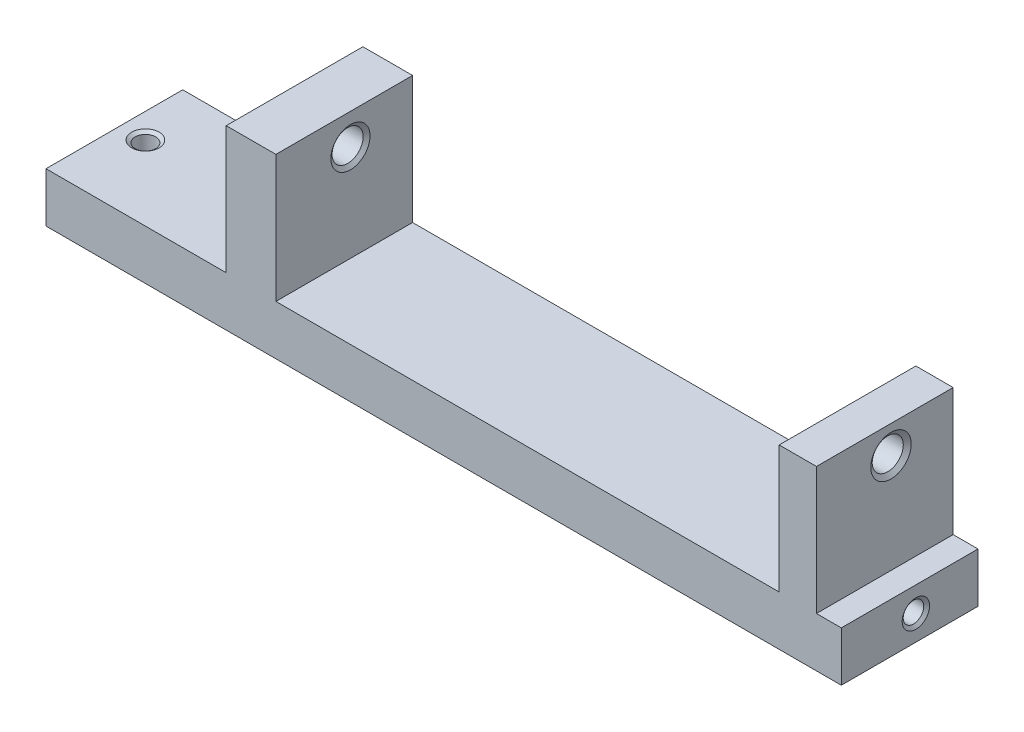
ISO-10303-21;
HEADER;
FILE_DESCRIPTION(('STEP AP214'),'2;1');
FILE_NAME('part.step','',(''),(''),'','','');
FILE_SCHEMA(('AUTOMOTIVE_DESIGN { 1 0 10303 214 1 1 1 1 }'));
ENDSEC;
DATA;
#1=APPLICATION_CONTEXT('core data for automotive mechanical design processes');
#2=APPLICATION_PROTOCOL_DEFINITION('international standard','automotive_design',2000,#1);
#3=PRODUCT_CONTEXT('',#1,'mechanical');
#4=PRODUCT('Part','Part','',(#3));
#5=PRODUCT_RELATED_PRODUCT_CATEGORY('part','',(#4));
#6=PRODUCT_DEFINITION_FORMATION('','',#4);
#7=PRODUCT_DEFINITION_CONTEXT('part definition',#1,'design');
#8=PRODUCT_DEFINITION('design','',#6,#7);
#9=PRODUCT_DEFINITION_SHAPE('','',#8);
#10=(LENGTH_UNIT() NAMED_UNIT(*) SI_UNIT(.MILLI.,.METRE.));
#11=(NAMED_UNIT(*) PLANE_ANGLE_UNIT() SI_UNIT($,.RADIAN.));
#12=(NAMED_UNIT(*) SI_UNIT($,.STERADIAN.) SOLID_ANGLE_UNIT());
#13=UNCERTAINTY_MEASURE_WITH_UNIT(LENGTH_MEASURE(1.E-05),#10,'distance_accuracy_value','');
#14=(GEOMETRIC_REPRESENTATION_CONTEXT(3) GLOBAL_UNCERTAINTY_ASSIGNED_CONTEXT((#13)) GLOBAL_UNIT_ASSIGNED_CONTEXT((#10,
#11,#12)) REPRESENTATION_CONTEXT('',''));
#15=CARTESIAN_POINT('',(0.,0.,0.));
#16=DIRECTION('',(0.,0.,1.));
#17=DIRECTION('',(1.,0.,0.));
#18=AXIS2_PLACEMENT_3D('',#15,#16,#17);
#19=CARTESIAN_POINT('',(0.,7.99999999999998,22.));
#20=DIRECTION('',(1.,0.,0.));
#21=DIRECTION('',(0.,1.,0.));
#22=AXIS2_PLACEMENT_3D('',#19,#20,#21);
#23=PLANE('',#22);
#24=DIRECTION('',(0.,-1.,0.));
#25=VECTOR('',#24,1.);
#26=CARTESIAN_POINT('',(0.,7.99999999999998,0.));
#27=LINE('',#26,#25);
#28=CARTESIAN_POINT('',(0.,7.99999999999998,0.));
#29=VERTEX_POINT('',#28);
#30=CARTESIAN_POINT('',(0.,0.,0.));
#31=VERTEX_POINT('',#30);
#32=EDGE_CURVE('E153',#29,#31,#27,.T.);
#33=ORIENTED_EDGE('',*,*,#32,.T.);
#34=DIRECTION('',(0.,0.,-1.));
#35=VECTOR('',#34,1.);
#36=CARTESIAN_POINT('',(0.,0.,22.));
#37=LINE('',#36,#35);
#38=CARTESIAN_POINT('',(0.,0.,22.));
#39=VERTEX_POINT('',#38);
#40=EDGE_CURVE('E11',#39,#31,#37,.T.);
#41=ORIENTED_EDGE('',*,*,#40,.F.);
#42=DIRECTION('',(0.,-1.,0.));
#43=VECTOR('',#42,1.);
#44=CARTESIAN_POINT('',(0.,7.99999999999998,22.));
#45=LINE('',#44,#43);
#46=CARTESIAN_POINT('',(0.,7.99999999999998,22.));
#47=VERTEX_POINT('',#46);
#48=EDGE_CURVE('E176',#47,#39,#45,.T.);
#49=ORIENTED_EDGE('',*,*,#48,.F.);
#50=DIRECTION('',(0.,0.,-1.));
#51=VECTOR('',#50,1.);
#52=CARTESIAN_POINT('',(0.,7.99999999999998,22.));
#53=LINE('',#52,#51);
#54=EDGE_CURVE('E149',#47,#29,#53,.T.);
#55=ORIENTED_EDGE('',*,*,#54,.T.);
#56=EDGE_LOOP('',(#33,#41,#49,#55));
#57=FACE_BOUND('',#56,.T.);
#58=ADVANCED_FACE('F31',(#57),#23,.F.);
#59=CARTESIAN_POINT('',(0.,0.,22.));
#60=DIRECTION('',(0.,1.,0.));
#61=DIRECTION('',(0.,0.,1.));
#62=AXIS2_PLACEMENT_3D('',#59,#60,#61);
#63=PLANE('',#62);
#64=CARTESIAN_POINT('',(4.,0.,10.));
#65=DIRECTION('',(0.,-1.,0.));
#66=DIRECTION('',(0.,0.,-1.));
#67=AXIS2_PLACEMENT_3D('',#64,#65,#66);
#68=CIRCLE('',#67,2.2);
#69=CARTESIAN_POINT('',(4.,0.,7.8));
#70=VERTEX_POINT('',#69);
#71=EDGE_CURVE('E481',#70,#70,#68,.T.);
#72=ORIENTED_EDGE('',*,*,#71,.F.);
#73=EDGE_LOOP('',(#72));
#74=FACE_BOUND('',#73,.T.);
#75=DIRECTION('',(1.,0.,0.));
#76=VECTOR('',#75,1.);
#77=CARTESIAN_POINT('',(0.,0.,0.));
#78=LINE('',#77,#76);
#79=CARTESIAN_POINT('',(128.,0.,0.));
#80=VERTEX_POINT('',#79);
#81=EDGE_CURVE('E156',#31,#80,#78,.T.);
#82=ORIENTED_EDGE('',*,*,#81,.T.);
#83=DIRECTION('',(0.,0.,-1.));
#84=VECTOR('',#83,1.);
#85=CARTESIAN_POINT('',(128.,0.,22.));
#86=LINE('',#85,#84);
#87=CARTESIAN_POINT('',(128.,0.,22.));
#88=VERTEX_POINT('',#87);
#89=EDGE_CURVE('E39',#88,#80,#86,.T.);
#90=ORIENTED_EDGE('',*,*,#89,.F.);
#91=DIRECTION('',(1.,0.,0.));
#92=VECTOR('',#91,1.);
#93=CARTESIAN_POINT('',(0.,0.,22.));
#94=LINE('',#93,#92);
#95=EDGE_CURVE('E103',#39,#88,#94,.T.);
#96=ORIENTED_EDGE('',*,*,#95,.F.);
#97=ORIENTED_EDGE('',*,*,#40,.T.);
#98=EDGE_LOOP('',(#82,#90,#96,#97));
#99=FACE_BOUND('',#98,.T.);
#100=ADVANCED_FACE('F257',(#74,#99),#63,.F.);
#101=CARTESIAN_POINT('',(128.,0.,22.));
#102=DIRECTION('',(-1.,0.,0.));
#103=DIRECTION('',(0.,0.,1.));
#104=AXIS2_PLACEMENT_3D('',#101,#102,#103);
#105=PLANE('',#104);
#106=CARTESIAN_POINT('',(128.,4.,10.));
#107=DIRECTION('',(1.,0.,0.));
#108=DIRECTION('',(0.,0.,-1.));
#109=AXIS2_PLACEMENT_3D('',#106,#107,#108);
#110=CIRCLE('',#109,2.2);
#111=CARTESIAN_POINT('',(128.,4.,7.8));
#112=VERTEX_POINT('',#111);
#113=EDGE_CURVE('E472',#112,#112,#110,.T.);
#114=ORIENTED_EDGE('',*,*,#113,.F.);
#115=EDGE_LOOP('',(#114));
#116=FACE_BOUND('',#115,.T.);
#117=DIRECTION('',(0.,1.,0.));
#118=VECTOR('',#117,1.);
#119=CARTESIAN_POINT('',(128.,0.,0.));
#120=LINE('',#119,#118);
#121=CARTESIAN_POINT('',(128.,8.,0.));
#122=VERTEX_POINT('',#121);
#123=EDGE_CURVE('E159',#80,#122,#120,.T.);
#124=ORIENTED_EDGE('',*,*,#123,.T.);
#125=DIRECTION('',(0.,0.,-1.));
#126=VECTOR('',#125,1.);
#127=CARTESIAN_POINT('',(128.,8.,22.));
#128=LINE('',#127,#126);
#129=CARTESIAN_POINT('',(128.,8.,22.));
#130=VERTEX_POINT('',#129);
#131=EDGE_CURVE('E195',#130,#122,#128,.T.);
#132=ORIENTED_EDGE('',*,*,#131,.F.);
#133=DIRECTION('',(0.,1.,0.));
#134=VECTOR('',#133,1.);
#135=CARTESIAN_POINT('',(128.,0.,22.));
#136=LINE('',#135,#134);
#137=EDGE_CURVE('E203',#88,#130,#136,.T.);
#138=ORIENTED_EDGE('',*,*,#137,.F.);
#139=ORIENTED_EDGE('',*,*,#89,.T.);
#140=EDGE_LOOP('',(#124,#132,#138,#139));
#141=FACE_BOUND('',#140,.T.);
#142=ADVANCED_FACE('F201',(#116,#141),#105,.F.);
#143=CARTESIAN_POINT('',(128.,8.,22.));
#144=DIRECTION('',(0.,-1.,0.));
#145=DIRECTION('',(0.,0.,-1.));
#146=AXIS2_PLACEMENT_3D('',#143,#144,#145);
#147=PLANE('',#146);
#148=DIRECTION('',(-1.,0.,0.));
#149=VECTOR('',#148,1.);
#150=CARTESIAN_POINT('',(128.,8.,0.));
#151=LINE('',#150,#149);
#152=CARTESIAN_POINT('',(124.,8.,0.));
#153=VERTEX_POINT('',#152);
#154=EDGE_CURVE('E161',#122,#153,#151,.T.);
#155=ORIENTED_EDGE('',*,*,#154,.T.);
#156=DIRECTION('',(0.,0.,-1.));
#157=VECTOR('',#156,1.);
#158=CARTESIAN_POINT('',(124.,8.,22.));
#159=LINE('',#158,#157);
#160=CARTESIAN_POINT('',(124.,8.,22.));
#161=VERTEX_POINT('',#160);
#162=EDGE_CURVE('E192',#161,#153,#159,.T.);
#163=ORIENTED_EDGE('',*,*,#162,.F.);
#164=DIRECTION('',(-1.,0.,0.));
#165=VECTOR('',#164,1.);
#166=CARTESIAN_POINT('',(128.,8.,22.));
#167=LINE('',#166,#165);
#168=EDGE_CURVE('E221',#130,#161,#167,.T.);
#169=ORIENTED_EDGE('',*,*,#168,.F.);
#170=ORIENTED_EDGE('',*,*,#131,.T.);
#171=EDGE_LOOP('',(#155,#163,#169,#170));
#172=FACE_BOUND('',#171,.T.);
#173=ADVANCED_FACE('F212',(#172),#147,.F.);
#174=CARTESIAN_POINT('',(124.,8.,22.));
#175=DIRECTION('',(-1.,0.,0.));
#176=DIRECTION('',(0.,0.,1.));
#177=AXIS2_PLACEMENT_3D('',#174,#175,#176);
#178=PLANE('',#177);
#179=CARTESIAN_POINT('',(124.,24.,10.));
#180=DIRECTION('',(1.,0.,0.));
#181=DIRECTION('',(0.,0.,-1.));
#182=AXIS2_PLACEMENT_3D('',#179,#180,#181);
#183=CIRCLE('',#182,3.25);
#184=CARTESIAN_POINT('',(124.,24.,6.75));
#185=VERTEX_POINT('',#184);
#186=EDGE_CURVE('E493',#185,#185,#183,.T.);
#187=ORIENTED_EDGE('',*,*,#186,.F.);
#188=EDGE_LOOP('',(#187));
#189=FACE_BOUND('',#188,.T.);
#190=DIRECTION('',(0.,1.,0.));
#191=VECTOR('',#190,1.);
#192=CARTESIAN_POINT('',(124.,8.,0.));
#193=LINE('',#192,#191);
#194=CARTESIAN_POINT('',(124.,28.5,0.));
#195=VERTEX_POINT('',#194);
#196=EDGE_CURVE('E163',#153,#195,#193,.T.);
#197=ORIENTED_EDGE('',*,*,#196,.T.);
#198=DIRECTION('',(0.,0.,-1.));
#199=VECTOR('',#198,1.);
#200=CARTESIAN_POINT('',(124.,28.5,22.));
#201=LINE('',#200,#199);
#202=CARTESIAN_POINT('',(124.,28.5,22.));
#203=VERTEX_POINT('',#202);
#204=EDGE_CURVE('E189',#203,#195,#201,.T.);
#205=ORIENTED_EDGE('',*,*,#204,.F.);
#206=DIRECTION('',(0.,1.,0.));
#207=VECTOR('',#206,1.);
#208=CARTESIAN_POINT('',(124.,8.,22.));
#209=LINE('',#208,#207);
#210=EDGE_CURVE('E218',#161,#203,#209,.T.);
#211=ORIENTED_EDGE('',*,*,#210,.F.);
#212=ORIENTED_EDGE('',*,*,#162,.T.);
#213=EDGE_LOOP('',(#197,#205,#211,#212));
#214=FACE_BOUND('',#213,.T.);
#215=ADVANCED_FACE('F216',(#189,#214),#178,.F.);
#216=CARTESIAN_POINT('',(124.,28.5,22.));
#217=DIRECTION('',(0.,-1.,0.));
#218=DIRECTION('',(0.,0.,-1.));
#219=AXIS2_PLACEMENT_3D('',#216,#217,#218);
#220=PLANE('',#219);
#221=DIRECTION('',(-1.,0.,0.));
#222=VECTOR('',#221,1.);
#223=CARTESIAN_POINT('',(124.,28.5,0.));
#224=LINE('',#223,#222);
#225=CARTESIAN_POINT('',(118.,28.5,0.));
#226=VERTEX_POINT('',#225);
#227=EDGE_CURVE('E165',#195,#226,#224,.T.);
#228=ORIENTED_EDGE('',*,*,#227,.T.);
#229=DIRECTION('',(0.,0.,-1.));
#230=VECTOR('',#229,1.);
#231=CARTESIAN_POINT('',(118.,28.5,22.));
#232=LINE('',#231,#230);
#233=CARTESIAN_POINT('',(118.,28.5,22.));
#234=VERTEX_POINT('',#233);
#235=EDGE_CURVE('E186',#234,#226,#232,.T.);
#236=ORIENTED_EDGE('',*,*,#235,.F.);
#237=DIRECTION('',(-1.,0.,0.));
#238=VECTOR('',#237,1.);
#239=CARTESIAN_POINT('',(124.,28.5,22.));
#240=LINE('',#239,#238);
#241=EDGE_CURVE('E220',#203,#234,#240,.T.);
#242=ORIENTED_EDGE('',*,*,#241,.F.);
#243=ORIENTED_EDGE('',*,*,#204,.T.);
#244=EDGE_LOOP('',(#228,#236,#242,#243));
#245=FACE_BOUND('',#244,.T.);
#246=ADVANCED_FACE('F273',(#245),#220,.F.);
#247=CARTESIAN_POINT('',(118.,28.5,22.));
#248=DIRECTION('',(1.,0.,0.));
#249=DIRECTION('',(0.,0.,-1.));
#250=AXIS2_PLACEMENT_3D('',#247,#248,#249);
#251=PLANE('',#250);
#252=CARTESIAN_POINT('',(118.,24.,10.));
#253=DIRECTION('',(1.,0.,0.));
#254=DIRECTION('',(0.,0.,-1.));
#255=AXIS2_PLACEMENT_3D('',#252,#253,#254);
#256=CIRCLE('',#255,3.25);
#257=CARTESIAN_POINT('',(118.,24.,6.75));
#258=VERTEX_POINT('',#257);
#259=EDGE_CURVE('E490',#258,#258,#256,.T.);
#260=ORIENTED_EDGE('',*,*,#259,.T.);
#261=EDGE_LOOP('',(#260));
#262=FACE_BOUND('',#261,.T.);
#263=DIRECTION('',(0.,-1.,0.));
#264=VECTOR('',#263,1.);
#265=CARTESIAN_POINT('',(118.,28.5,0.));
#266=LINE('',#265,#264);
#267=CARTESIAN_POINT('',(118.,8.,0.));
#268=VERTEX_POINT('',#267);
#269=EDGE_CURVE('E167',#226,#268,#266,.T.);
#270=ORIENTED_EDGE('',*,*,#269,.T.);
#271=DIRECTION('',(0.,0.,-1.));
#272=VECTOR('',#271,1.);
#273=CARTESIAN_POINT('',(118.,8.,22.));
#274=LINE('',#273,#272);
#275=CARTESIAN_POINT('',(118.,8.,22.));
#276=VERTEX_POINT('',#275);
#277=EDGE_CURVE('E183',#276,#268,#274,.T.);
#278=ORIENTED_EDGE('',*,*,#277,.F.);
#279=DIRECTION('',(0.,-1.,0.));
#280=VECTOR('',#279,1.);
#281=CARTESIAN_POINT('',(118.,28.5,22.));
#282=LINE('',#281,#280);
#283=EDGE_CURVE('E223',#234,#276,#282,.T.);
#284=ORIENTED_EDGE('',*,*,#283,.F.);
#285=ORIENTED_EDGE('',*,*,#235,.T.);
#286=EDGE_LOOP('',(#270,#278,#284,#285));
#287=FACE_BOUND('',#286,.T.);
#288=ADVANCED_FACE('F277',(#262,#287),#251,.F.);
#289=CARTESIAN_POINT('',(118.,8.,22.));
#290=DIRECTION('',(0.,-1.,0.));
#291=DIRECTION('',(1.,0.,0.));
#292=AXIS2_PLACEMENT_3D('',#289,#290,#291);
#293=PLANE('',#292);
#294=DIRECTION('',(-1.,0.,0.));
#295=VECTOR('',#294,1.);
#296=CARTESIAN_POINT('',(118.,8.,0.));
#297=LINE('',#296,#295);
#298=CARTESIAN_POINT('',(37.,7.99999999999999,0.));
#299=VERTEX_POINT('',#298);
#300=EDGE_CURVE('E169',#268,#299,#297,.T.);
#301=ORIENTED_EDGE('',*,*,#300,.T.);
#302=DIRECTION('',(0.,0.,-1.));
#303=VECTOR('',#302,1.);
#304=CARTESIAN_POINT('',(37.,7.99999999999999,22.));
#305=LINE('',#304,#303);
#306=CARTESIAN_POINT('',(37.,7.99999999999999,22.));
#307=VERTEX_POINT('',#306);
#308=EDGE_CURVE('E180',#307,#299,#305,.T.);
#309=ORIENTED_EDGE('',*,*,#308,.F.);
#310=DIRECTION('',(-1.,0.,0.));
#311=VECTOR('',#310,1.);
#312=CARTESIAN_POINT('',(118.,8.,22.));
#313=LINE('',#312,#311);
#314=EDGE_CURVE('E229',#276,#307,#313,.T.);
#315=ORIENTED_EDGE('',*,*,#314,.F.);
#316=ORIENTED_EDGE('',*,*,#277,.T.);
#317=EDGE_LOOP('',(#301,#309,#315,#316));
#318=FACE_BOUND('',#317,.T.);
#319=ADVANCED_FACE('F235',(#318),#293,.F.);
#320=CARTESIAN_POINT('',(37.,7.99999999999999,22.));
#321=DIRECTION('',(-1.,0.,0.));
#322=DIRECTION('',(0.,0.,1.));
#323=AXIS2_PLACEMENT_3D('',#320,#321,#322);
#324=PLANE('',#323);
#325=CARTESIAN_POINT('',(37.,23.5,10.));
#326=DIRECTION('',(-1.,0.,0.));
#327=DIRECTION('',(0.,0.,1.));
#328=AXIS2_PLACEMENT_3D('',#325,#326,#327);
#329=CIRCLE('',#328,3.15);
#330=CARTESIAN_POINT('',(37.,23.5,13.15));
#331=VERTEX_POINT('',#330);
#332=EDGE_CURVE('E502',#331,#331,#329,.T.);
#333=ORIENTED_EDGE('',*,*,#332,.T.);
#334=EDGE_LOOP('',(#333));
#335=FACE_BOUND('',#334,.T.);
#336=DIRECTION('',(0.,1.,0.));
#337=VECTOR('',#336,1.);
#338=CARTESIAN_POINT('',(37.,7.99999999999999,0.));
#339=LINE('',#338,#337);
#340=CARTESIAN_POINT('',(37.,28.5,0.));
#341=VERTEX_POINT('',#340);
#342=EDGE_CURVE('E171',#299,#341,#339,.T.);
#343=ORIENTED_EDGE('',*,*,#342,.T.);
#344=DIRECTION('',(0.,0.,-1.));
#345=VECTOR('',#344,1.);
#346=CARTESIAN_POINT('',(37.,28.5,22.));
#347=LINE('',#346,#345);
#348=CARTESIAN_POINT('',(37.,28.5,22.));
#349=VERTEX_POINT('',#348);
#350=EDGE_CURVE('E144',#349,#341,#347,.T.);
#351=ORIENTED_EDGE('',*,*,#350,.F.);
#352=DIRECTION('',(0.,1.,0.));
#353=VECTOR('',#352,1.);
#354=CARTESIAN_POINT('',(37.,7.99999999999999,22.));
#355=LINE('',#354,#353);
#356=EDGE_CURVE('E135',#307,#349,#355,.T.);
#357=ORIENTED_EDGE('',*,*,#356,.F.);
#358=ORIENTED_EDGE('',*,*,#308,.T.);
#359=EDGE_LOOP('',(#343,#351,#357,#358));
#360=FACE_BOUND('',#359,.T.);
#361=ADVANCED_FACE('F239',(#335,#360),#324,.F.);
#362=CARTESIAN_POINT('',(37.,28.5,22.));
#363=DIRECTION('',(0.,-1.,0.));
#364=DIRECTION('',(0.,0.,-1.));
#365=AXIS2_PLACEMENT_3D('',#362,#363,#364);
#366=PLANE('',#365);
#367=DIRECTION('',(-1.,0.,0.));
#368=VECTOR('',#367,1.);
#369=CARTESIAN_POINT('',(37.,28.5,0.));
#370=LINE('',#369,#368);
#371=CARTESIAN_POINT('',(29.,28.5,0.));
#372=VERTEX_POINT('',#371);
#373=EDGE_CURVE('E143',#341,#372,#370,.T.);
#374=ORIENTED_EDGE('',*,*,#373,.T.);
#375=DIRECTION('',(0.,0.,-1.));
#376=VECTOR('',#375,1.);
#377=CARTESIAN_POINT('',(29.,28.5,22.));
#378=LINE('',#377,#376);
#379=CARTESIAN_POINT('',(29.,28.5,22.));
#380=VERTEX_POINT('',#379);
#381=EDGE_CURVE('E140',#380,#372,#378,.T.);
#382=ORIENTED_EDGE('',*,*,#381,.F.);
#383=DIRECTION('',(-1.,0.,0.));
#384=VECTOR('',#383,1.);
#385=CARTESIAN_POINT('',(37.,28.5,22.));
#386=LINE('',#385,#384);
#387=EDGE_CURVE('E129',#349,#380,#386,.T.);
#388=ORIENTED_EDGE('',*,*,#387,.F.);
#389=ORIENTED_EDGE('',*,*,#350,.T.);
#390=EDGE_LOOP('',(#374,#382,#388,#389));
#391=FACE_BOUND('',#390,.T.);
#392=ADVANCED_FACE('F141',(#391),#366,.F.);
#393=CARTESIAN_POINT('',(29.,28.5,22.));
#394=DIRECTION('',(1.,0.,0.));
#395=DIRECTION('',(0.,1.,0.));
#396=AXIS2_PLACEMENT_3D('',#393,#394,#395);
#397=PLANE('',#396);
#398=CARTESIAN_POINT('',(29.,23.5,10.));
#399=DIRECTION('',(-1.,0.,0.));
#400=DIRECTION('',(0.,0.,1.));
#401=AXIS2_PLACEMENT_3D('',#398,#399,#400);
#402=CIRCLE('',#401,3.15);
#403=CARTESIAN_POINT('',(29.,23.5,13.15));
#404=VERTEX_POINT('',#403);
#405=EDGE_CURVE('E505',#404,#404,#402,.T.);
#406=ORIENTED_EDGE('',*,*,#405,.F.);
#407=EDGE_LOOP('',(#406));
#408=FACE_BOUND('',#407,.T.);
#409=DIRECTION('',(0.,-1.,0.));
#410=VECTOR('',#409,1.);
#411=CARTESIAN_POINT('',(29.,28.5,0.));
#412=LINE('',#411,#410);
#413=CARTESIAN_POINT('',(29.,7.99999999999999,0.));
#414=VERTEX_POINT('',#413);
#415=EDGE_CURVE('E89',#372,#414,#412,.T.);
#416=ORIENTED_EDGE('',*,*,#415,.T.);
#417=DIRECTION('',(0.,0.,-1.));
#418=VECTOR('',#417,1.);
#419=CARTESIAN_POINT('',(29.,7.99999999999999,22.));
#420=LINE('',#419,#418);
#421=CARTESIAN_POINT('',(29.,7.99999999999999,22.));
#422=VERTEX_POINT('',#421);
#423=EDGE_CURVE('E145',#422,#414,#420,.T.);
#424=ORIENTED_EDGE('',*,*,#423,.F.);
#425=DIRECTION('',(0.,-1.,0.));
#426=VECTOR('',#425,1.);
#427=CARTESIAN_POINT('',(29.,28.5,22.));
#428=LINE('',#427,#426);
#429=EDGE_CURVE('E133',#380,#422,#428,.T.);
#430=ORIENTED_EDGE('',*,*,#429,.F.);
#431=ORIENTED_EDGE('',*,*,#381,.T.);
#432=EDGE_LOOP('',(#416,#424,#430,#431));
#433=FACE_BOUND('',#432,.T.);
#434=ADVANCED_FACE('F147',(#408,#433),#397,.F.);
#435=CARTESIAN_POINT('',(29.,7.99999999999999,22.));
#436=DIRECTION('',(0.,-1.,0.));
#437=DIRECTION('',(1.,0.,0.));
#438=AXIS2_PLACEMENT_3D('',#435,#436,#437);
#439=PLANE('',#438);
#440=CARTESIAN_POINT('',(4.,7.99999999999998,10.));
#441=DIRECTION('',(0.,-1.,0.));
#442=DIRECTION('',(0.,0.,-1.));
#443=AXIS2_PLACEMENT_3D('',#440,#441,#442);
#444=CIRCLE('',#443,2.2);
#445=CARTESIAN_POINT('',(4.,7.99999999999998,7.8));
#446=VERTEX_POINT('',#445);
#447=EDGE_CURVE('E479',#446,#446,#444,.T.);
#448=ORIENTED_EDGE('',*,*,#447,.T.);
#449=EDGE_LOOP('',(#448));
#450=FACE_BOUND('',#449,.T.);
#451=DIRECTION('',(-1.,0.,0.));
#452=VECTOR('',#451,1.);
#453=CARTESIAN_POINT('',(29.,7.99999999999999,0.));
#454=LINE('',#453,#452);
#455=EDGE_CURVE('E95',#414,#29,#454,.T.);
#456=ORIENTED_EDGE('',*,*,#455,.T.);
#457=ORIENTED_EDGE('',*,*,#54,.F.);
#458=DIRECTION('',(-1.,0.,0.));
#459=VECTOR('',#458,1.);
#460=CARTESIAN_POINT('',(29.,7.99999999999999,22.));
#461=LINE('',#460,#459);
#462=EDGE_CURVE('E47',#422,#47,#461,.T.);
#463=ORIENTED_EDGE('',*,*,#462,.F.);
#464=ORIENTED_EDGE('',*,*,#423,.T.);
#465=EDGE_LOOP('',(#456,#457,#463,#464));
#466=FACE_BOUND('',#465,.T.);
#467=ADVANCED_FACE('F243',(#450,#466),#439,.F.);
#468=CARTESIAN_POINT('',(0.,0.,22.));
#469=DIRECTION('',(0.,0.,1.));
#470=DIRECTION('',(1.,0.,0.));
#471=AXIS2_PLACEMENT_3D('',#468,#469,#470);
#472=PLANE('',#471);
#473=ORIENTED_EDGE('',*,*,#48,.T.);
#474=ORIENTED_EDGE('',*,*,#95,.T.);
#475=ORIENTED_EDGE('',*,*,#137,.T.);
#476=ORIENTED_EDGE('',*,*,#168,.T.);
#477=ORIENTED_EDGE('',*,*,#210,.T.);
#478=ORIENTED_EDGE('',*,*,#241,.T.);
#479=ORIENTED_EDGE('',*,*,#283,.T.);
#480=ORIENTED_EDGE('',*,*,#314,.T.);
#481=ORIENTED_EDGE('',*,*,#356,.T.);
#482=ORIENTED_EDGE('',*,*,#387,.T.);
#483=ORIENTED_EDGE('',*,*,#429,.T.);
#484=ORIENTED_EDGE('',*,*,#462,.T.);
#485=EDGE_LOOP('',(#473,#474,#475,#476,#477,#478,#479,#480,#481,#482,#483,#484));
#486=FACE_BOUND('',#485,.T.);
#487=ADVANCED_FACE('F131',(#486),#472,.T.);
#488=CARTESIAN_POINT('',(0.,0.,0.));
#489=DIRECTION('',(0.,0.,1.));
#490=DIRECTION('',(1.,0.,0.));
#491=AXIS2_PLACEMENT_3D('',#488,#489,#490);
#492=PLANE('',#491);
#493=ORIENTED_EDGE('',*,*,#32,.F.);
#494=ORIENTED_EDGE('',*,*,#455,.F.);
#495=ORIENTED_EDGE('',*,*,#415,.F.);
#496=ORIENTED_EDGE('',*,*,#373,.F.);
#497=ORIENTED_EDGE('',*,*,#342,.F.);
#498=ORIENTED_EDGE('',*,*,#300,.F.);
#499=ORIENTED_EDGE('',*,*,#269,.F.);
#500=ORIENTED_EDGE('',*,*,#227,.F.);
#501=ORIENTED_EDGE('',*,*,#196,.F.);
#502=ORIENTED_EDGE('',*,*,#154,.F.);
#503=ORIENTED_EDGE('',*,*,#123,.F.);
#504=ORIENTED_EDGE('',*,*,#81,.F.);
#505=EDGE_LOOP('',(#493,#494,#495,#496,#497,#498,#499,#500,#501,#502,#503,#504));
#506=FACE_BOUND('',#505,.T.);
#507=ADVANCED_FACE('F207',(#506),#492,.F.);
#508=CARTESIAN_POINT('',(36.5448651001637,23.5,10.));
#509=DIRECTION('',(1.,0.,0.));
#510=DIRECTION('',(0.,0.,-1.));
#511=AXIS2_PLACEMENT_3D('',#508,#509,#510);
#512=CONICAL_SURFACE('',#511,2.5,0.959931088596888);
#513=ORIENTED_EDGE('',*,*,#332,.F.);
#514=EDGE_LOOP('',(#513));
#515=FACE_BOUND('',#514,.T.);
#516=CARTESIAN_POINT('',(36.5448651001637,23.5,10.));
#517=DIRECTION('',(-1.,0.,0.));
#518=DIRECTION('',(0.,0.,1.));
#519=AXIS2_PLACEMENT_3D('',#516,#517,#518);
#520=CIRCLE('',#519,2.5);
#521=CARTESIAN_POINT('',(36.5448651001637,23.5,12.5));
#522=VERTEX_POINT('',#521);
#523=EDGE_CURVE('E157',#522,#522,#520,.T.);
#524=ORIENTED_EDGE('',*,*,#523,.T.);
#525=EDGE_LOOP('',(#524));
#526=FACE_BOUND('',#525,.T.);
#527=ADVANCED_FACE('F307',(#515,#526),#512,.F.);
#528=CARTESIAN_POINT('',(29.,23.5,10.));
#529=DIRECTION('',(-1.,0.,0.));
#530=DIRECTION('',(0.,0.,1.));
#531=AXIS2_PLACEMENT_3D('',#528,#529,#530);
#532=CYLINDRICAL_SURFACE('',#531,2.5);
#533=ORIENTED_EDGE('',*,*,#523,.F.);
#534=EDGE_LOOP('',(#533));
#535=FACE_BOUND('',#534,.T.);
#536=CARTESIAN_POINT('',(29.4551348998363,23.5,10.));
#537=DIRECTION('',(-1.,0.,0.));
#538=DIRECTION('',(0.,0.,1.));
#539=AXIS2_PLACEMENT_3D('',#536,#537,#538);
#540=CIRCLE('',#539,2.5);
#541=CARTESIAN_POINT('',(29.4551348998363,23.5,12.5));
#542=VERTEX_POINT('',#541);
#543=EDGE_CURVE('E508',#542,#542,#540,.T.);
#544=ORIENTED_EDGE('',*,*,#543,.T.);
#545=EDGE_LOOP('',(#544));
#546=FACE_BOUND('',#545,.T.);
#547=ADVANCED_FACE('F312',(#535,#546),#532,.F.);
#548=CARTESIAN_POINT('',(29.,23.5,10.));
#549=DIRECTION('',(-1.,0.,0.));
#550=DIRECTION('',(0.,0.,1.));
#551=AXIS2_PLACEMENT_3D('',#548,#549,#550);
#552=CONICAL_SURFACE('',#551,3.15,0.959931088596885);
#553=ORIENTED_EDGE('',*,*,#543,.F.);
#554=EDGE_LOOP('',(#553));
#555=FACE_BOUND('',#554,.T.);
#556=ORIENTED_EDGE('',*,*,#405,.T.);
#557=EDGE_LOOP('',(#556));
#558=FACE_BOUND('',#557,.T.);
#559=ADVANCED_FACE('F324',(#555,#558),#552,.F.);
#560=CARTESIAN_POINT('',(118.525155653657,24.,10.));
#561=DIRECTION('',(-1.,0.,0.));
#562=DIRECTION('',(0.,0.,1.));
#563=AXIS2_PLACEMENT_3D('',#560,#561,#562);
#564=CONICAL_SURFACE('',#563,2.5,0.959931088596883);
#565=ORIENTED_EDGE('',*,*,#259,.F.);
#566=EDGE_LOOP('',(#565));
#567=FACE_BOUND('',#566,.T.);
#568=CARTESIAN_POINT('',(118.525155653657,24.,10.));
#569=DIRECTION('',(1.,0.,0.));
#570=DIRECTION('',(0.,0.,-1.));
#571=AXIS2_PLACEMENT_3D('',#568,#569,#570);
#572=CIRCLE('',#571,2.5);
#573=CARTESIAN_POINT('',(118.525155653657,24.,7.5));
#574=VERTEX_POINT('',#573);
#575=EDGE_CURVE('E499',#574,#574,#572,.T.);
#576=ORIENTED_EDGE('',*,*,#575,.T.);
#577=EDGE_LOOP('',(#576));
#578=FACE_BOUND('',#577,.T.);
#579=ADVANCED_FACE('F334',(#567,#578),#564,.F.);
#580=CARTESIAN_POINT('',(124.,24.,10.));
#581=DIRECTION('',(1.,0.,0.));
#582=DIRECTION('',(0.,0.,-1.));
#583=AXIS2_PLACEMENT_3D('',#580,#581,#582);
#584=CYLINDRICAL_SURFACE('',#583,2.5);
#585=ORIENTED_EDGE('',*,*,#575,.F.);
#586=EDGE_LOOP('',(#585));
#587=FACE_BOUND('',#586,.T.);
#588=CARTESIAN_POINT('',(123.474844346343,24.,10.));
#589=DIRECTION('',(1.,0.,0.));
#590=DIRECTION('',(0.,0.,-1.));
#591=AXIS2_PLACEMENT_3D('',#588,#589,#590);
#592=CIRCLE('',#591,2.5);
#593=CARTESIAN_POINT('',(123.474844346343,24.,7.5));
#594=VERTEX_POINT('',#593);
#595=EDGE_CURVE('E496',#594,#594,#592,.T.);
#596=ORIENTED_EDGE('',*,*,#595,.T.);
#597=EDGE_LOOP('',(#596));
#598=FACE_BOUND('',#597,.T.);
#599=ADVANCED_FACE('F359',(#587,#598),#584,.F.);
#600=CARTESIAN_POINT('',(124.,24.,10.));
#601=DIRECTION('',(1.,0.,0.));
#602=DIRECTION('',(0.,0.,-1.));
#603=AXIS2_PLACEMENT_3D('',#600,#601,#602);
#604=CONICAL_SURFACE('',#603,3.25,0.959931088596883);
#605=ORIENTED_EDGE('',*,*,#595,.F.);
#606=EDGE_LOOP('',(#605));
#607=FACE_BOUND('',#606,.T.);
#608=ORIENTED_EDGE('',*,*,#186,.T.);
#609=EDGE_LOOP('',(#608));
#610=FACE_BOUND('',#609,.T.);
#611=ADVANCED_FACE('F369',(#607,#610),#604,.F.);
#612=CARTESIAN_POINT('',(4.,7.61488585398464,10.));
#613=DIRECTION('',(0.,1.,0.));
#614=DIRECTION('',(0.,0.,1.));
#615=AXIS2_PLACEMENT_3D('',#612,#613,#614);
#616=CONICAL_SURFACE('',#615,1.65,0.95993108859688);
#617=ORIENTED_EDGE('',*,*,#447,.F.);
#618=EDGE_LOOP('',(#617));
#619=FACE_BOUND('',#618,.T.);
#620=CARTESIAN_POINT('',(4.,7.61488585398464,10.));
#621=DIRECTION('',(0.,-1.,0.));
#622=DIRECTION('',(0.,0.,-1.));
#623=AXIS2_PLACEMENT_3D('',#620,#621,#622);
#624=CIRCLE('',#623,1.65);
#625=CARTESIAN_POINT('',(4.,7.61488585398464,8.35));
#626=VERTEX_POINT('',#625);
#627=EDGE_CURVE('E487',#626,#626,#624,.T.);
#628=ORIENTED_EDGE('',*,*,#627,.T.);
#629=EDGE_LOOP('',(#628));
#630=FACE_BOUND('',#629,.T.);
#631=ADVANCED_FACE('F378',(#619,#630),#616,.F.);
#632=CARTESIAN_POINT('',(4.,0.,10.));
#633=DIRECTION('',(0.,-1.,0.));
#634=DIRECTION('',(0.,0.,-1.));
#635=AXIS2_PLACEMENT_3D('',#632,#633,#634);
#636=CYLINDRICAL_SURFACE('',#635,1.65);
#637=ORIENTED_EDGE('',*,*,#627,.F.);
#638=EDGE_LOOP('',(#637));
#639=FACE_BOUND('',#638,.T.);
#640=CARTESIAN_POINT('',(4.,0.385114146015343,10.));
#641=DIRECTION('',(0.,-1.,0.));
#642=DIRECTION('',(0.,0.,-1.));
#643=AXIS2_PLACEMENT_3D('',#640,#641,#642);
#644=CIRCLE('',#643,1.65);
#645=CARTESIAN_POINT('',(4.,0.385114146015343,8.35));
#646=VERTEX_POINT('',#645);
#647=EDGE_CURVE('E484',#646,#646,#644,.T.);
#648=ORIENTED_EDGE('',*,*,#647,.T.);
#649=EDGE_LOOP('',(#648));
#650=FACE_BOUND('',#649,.T.);
#651=ADVANCED_FACE('F399',(#639,#650),#636,.F.);
#652=CARTESIAN_POINT('',(4.,0.,10.));
#653=DIRECTION('',(0.,-1.,0.));
#654=DIRECTION('',(0.,0.,-1.));
#655=AXIS2_PLACEMENT_3D('',#652,#653,#654);
#656=CONICAL_SURFACE('',#655,2.2,0.95993108859688);
#657=ORIENTED_EDGE('',*,*,#647,.F.);
#658=EDGE_LOOP('',(#657));
#659=FACE_BOUND('',#658,.T.);
#660=ORIENTED_EDGE('',*,*,#71,.T.);
#661=EDGE_LOOP('',(#660));
#662=FACE_BOUND('',#661,.T.);
#663=ADVANCED_FACE('F409',(#659,#662),#656,.F.);
#664=CARTESIAN_POINT('',(116.5,4.,10.));
#665=DIRECTION('',(1.,0.,0.));
#666=DIRECTION('',(0.,0.,-1.));
#667=AXIS2_PLACEMENT_3D('',#664,#665,#666);
#668=CONICAL_SURFACE('',#667,1.64999999999999,1.02974425867665);
#669=CARTESIAN_POINT('',(115.508579978605,4.,10.));
#670=VERTEX_POINT('',#669);
#671=VERTEX_LOOP('',#670);
#672=FACE_BOUND('',#671,.T.);
#673=CARTESIAN_POINT('',(116.5,4.,10.));
#674=DIRECTION('',(1.,0.,0.));
#675=DIRECTION('',(0.,0.,-1.));
#676=AXIS2_PLACEMENT_3D('',#673,#674,#675);
#677=CIRCLE('',#676,1.64999999999999);
#678=CARTESIAN_POINT('',(116.5,4.,8.35000000000001));
#679=VERTEX_POINT('',#678);
#680=EDGE_CURVE('E474',#679,#679,#677,.T.);
#681=ORIENTED_EDGE('',*,*,#680,.T.);
#682=EDGE_LOOP('',(#681));
#683=FACE_BOUND('',#682,.T.);
#684=ADVANCED_FACE('F419',(#672,#683),#668,.F.);
#685=CARTESIAN_POINT('',(128.,4.,10.));
#686=DIRECTION('',(1.,0.,0.));
#687=DIRECTION('',(0.,0.,-1.));
#688=AXIS2_PLACEMENT_3D('',#685,#686,#687);
#689=CYLINDRICAL_SURFACE('',#688,1.64999999999999);
#690=ORIENTED_EDGE('',*,*,#680,.F.);
#691=EDGE_LOOP('',(#690));
#692=FACE_BOUND('',#691,.T.);
#693=CARTESIAN_POINT('',(127.614885853985,4.,10.));
#694=DIRECTION('',(1.,0.,0.));
#695=DIRECTION('',(0.,0.,-1.));
#696=AXIS2_PLACEMENT_3D('',#693,#694,#695);
#697=CIRCLE('',#696,1.65);
#698=CARTESIAN_POINT('',(127.614885853985,4.,8.35));
#699=VERTEX_POINT('',#698);
#700=EDGE_CURVE('E469',#699,#699,#697,.T.);
#701=ORIENTED_EDGE('',*,*,#700,.T.);
#702=EDGE_LOOP('',(#701));
#703=FACE_BOUND('',#702,.T.);
#704=ADVANCED_FACE('F434',(#692,#703),#689,.F.);
#705=CARTESIAN_POINT('',(128.,4.,10.));
#706=DIRECTION('',(1.,0.,0.));
#707=DIRECTION('',(0.,0.,-1.));
#708=AXIS2_PLACEMENT_3D('',#705,#706,#707);
#709=CONICAL_SURFACE('',#708,2.2,0.959931088596895);
#710=ORIENTED_EDGE('',*,*,#700,.F.);
#711=EDGE_LOOP('',(#710));
#712=FACE_BOUND('',#711,.T.);
#713=ORIENTED_EDGE('',*,*,#113,.T.);
#714=EDGE_LOOP('',(#713));
#715=FACE_BOUND('',#714,.T.);
#716=ADVANCED_FACE('F444',(#712,#715),#709,.F.);
#717=CLOSED_SHELL('',(#58,#100,#142,#173,#215,#246,#288,#319,#361,#392,#434,#467,#487,#507,#527,
#547,#559,#579,#599,#611,#631,#651,#663,#684,#704,#716));
#718=MANIFOLD_SOLID_BREP('B2',#717);
#719=ADVANCED_BREP_SHAPE_REPRESENTATION('',(#18,#718),#14);
#720=SHAPE_DEFINITION_REPRESENTATION(#9,#719);
ENDSEC;
END-ISO-10303-21;
